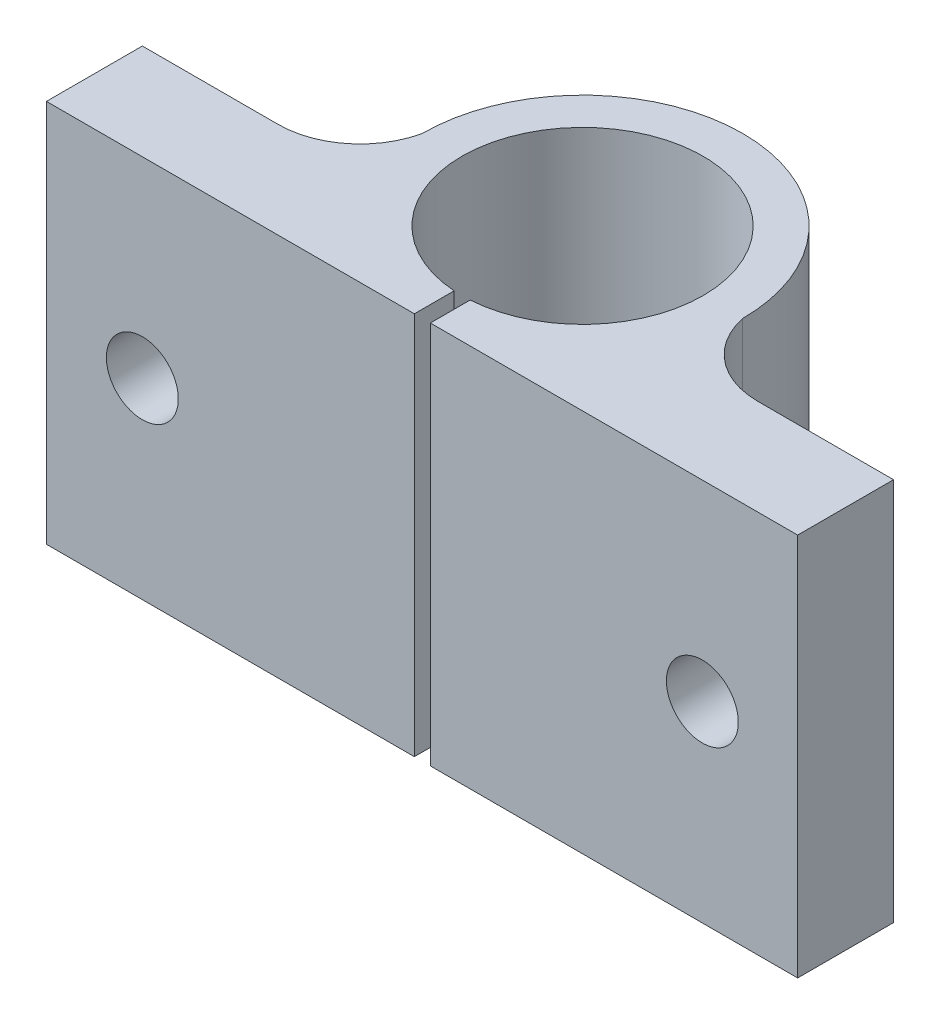
ISO-10303-21;
HEADER;
FILE_DESCRIPTION(('STEP AP214'),'2;1');
FILE_NAME('part.step','',(''),(''),'','','');
FILE_SCHEMA(('AUTOMOTIVE_DESIGN { 1 0 10303 214 1 1 1 1 }'));
ENDSEC;
DATA;
#1=APPLICATION_CONTEXT('core data for automotive mechanical design processes');
#2=APPLICATION_PROTOCOL_DEFINITION('international standard','automotive_design',2000,#1);
#3=PRODUCT_CONTEXT('',#1,'mechanical');
#4=PRODUCT('Part','Part','',(#3));
#5=PRODUCT_RELATED_PRODUCT_CATEGORY('part','',(#4));
#6=PRODUCT_DEFINITION_FORMATION('','',#4);
#7=PRODUCT_DEFINITION_CONTEXT('part definition',#1,'design');
#8=PRODUCT_DEFINITION('design','',#6,#7);
#9=PRODUCT_DEFINITION_SHAPE('','',#8);
#10=(LENGTH_UNIT() NAMED_UNIT(*) SI_UNIT(.MILLI.,.METRE.));
#11=(NAMED_UNIT(*) PLANE_ANGLE_UNIT() SI_UNIT($,.RADIAN.));
#12=(NAMED_UNIT(*) SI_UNIT($,.STERADIAN.) SOLID_ANGLE_UNIT());
#13=UNCERTAINTY_MEASURE_WITH_UNIT(LENGTH_MEASURE(1.E-05),#10,'distance_accuracy_value','');
#14=(GEOMETRIC_REPRESENTATION_CONTEXT(3) GLOBAL_UNCERTAINTY_ASSIGNED_CONTEXT((#13)) GLOBAL_UNIT_ASSIGNED_CONTEXT((#10,
#11,#12)) REPRESENTATION_CONTEXT('',''));
#15=CARTESIAN_POINT('',(0.,0.,0.));
#16=DIRECTION('',(0.,0.,1.));
#17=DIRECTION('',(1.,0.,0.));
#18=AXIS2_PLACEMENT_3D('',#15,#16,#17);
#19=CARTESIAN_POINT('',(0.,0.,0.));
#20=DIRECTION('',(0.,0.,1.));
#21=DIRECTION('',(1.,0.,0.));
#22=AXIS2_PLACEMENT_3D('',#19,#20,#21);
#23=PLANE('',#22);
#24=CARTESIAN_POINT('',(41.0372666212457,12.,0.));
#25=DIRECTION('',(0.,0.,-1.));
#26=DIRECTION('',(-1.,0.,0.));
#27=AXIS2_PLACEMENT_3D('',#24,#25,#26);
#28=CIRCLE('',#27,2.25000000000006);
#29=CARTESIAN_POINT('',(38.7872666212456,12.,0.));
#30=VERTEX_POINT('',#29);
#31=EDGE_CURVE('E224',#30,#30,#28,.T.);
#32=ORIENTED_EDGE('',*,*,#31,.T.);
#33=EDGE_LOOP('',(#32));
#34=FACE_BOUND('',#33,.T.);
#35=DIRECTION('',(0.,-1.,0.));
#36=VECTOR('',#35,1.);
#37=CARTESIAN_POINT('',(24.0186333106229,24.,0.));
#38=LINE('',#37,#36);
#39=CARTESIAN_POINT('',(24.0186333106229,24.,0.));
#40=VERTEX_POINT('',#39);
#41=CARTESIAN_POINT('',(24.0186333106229,0.,0.));
#42=VERTEX_POINT('',#41);
#43=EDGE_CURVE('E236',#40,#42,#38,.T.);
#44=ORIENTED_EDGE('',*,*,#43,.T.);
#45=DIRECTION('',(1.,0.,0.));
#46=VECTOR('',#45,1.);
#47=CARTESIAN_POINT('',(0.,0.,0.));
#48=LINE('',#47,#46);
#49=CARTESIAN_POINT('',(47.,0.,0.));
#50=VERTEX_POINT('',#49);
#51=EDGE_CURVE('E249',#42,#50,#48,.T.);
#52=ORIENTED_EDGE('',*,*,#51,.T.);
#53=DIRECTION('',(0.,1.,0.));
#54=VECTOR('',#53,1.);
#55=CARTESIAN_POINT('',(47.,0.,0.));
#56=LINE('',#55,#54);
#57=CARTESIAN_POINT('',(47.,24.,0.));
#58=VERTEX_POINT('',#57);
#59=EDGE_CURVE('E175',#50,#58,#56,.T.);
#60=ORIENTED_EDGE('',*,*,#59,.T.);
#61=DIRECTION('',(1.,0.,0.));
#62=VECTOR('',#61,1.);
#63=CARTESIAN_POINT('',(0.,24.,0.));
#64=LINE('',#63,#62);
#65=EDGE_CURVE('E149',#40,#58,#64,.T.);
#66=ORIENTED_EDGE('',*,*,#65,.F.);
#67=EDGE_LOOP('',(#44,#52,#60,#66));
#68=FACE_BOUND('',#67,.T.);
#69=ADVANCED_FACE('F34',(#34,#68),#23,.T.);
#70=CARTESIAN_POINT('',(0.,0.,-6.));
#71=DIRECTION('',(-1.,0.,0.));
#72=DIRECTION('',(0.,0.,1.));
#73=AXIS2_PLACEMENT_3D('',#70,#71,#72);
#74=PLANE('',#73);
#75=DIRECTION('',(0.,0.,1.));
#76=VECTOR('',#75,1.);
#77=CARTESIAN_POINT('',(0.,24.,-6.));
#78=LINE('',#77,#76);
#79=CARTESIAN_POINT('',(0.,24.,-6.));
#80=VERTEX_POINT('',#79);
#81=CARTESIAN_POINT('',(0.,24.,0.));
#82=VERTEX_POINT('',#81);
#83=EDGE_CURVE('E146',#80,#82,#78,.T.);
#84=ORIENTED_EDGE('',*,*,#83,.F.);
#85=DIRECTION('',(0.,1.,0.));
#86=VECTOR('',#85,1.);
#87=CARTESIAN_POINT('',(0.,0.,-6.));
#88=LINE('',#87,#86);
#89=CARTESIAN_POINT('',(0.,0.,-6.));
#90=VERTEX_POINT('',#89);
#91=EDGE_CURVE('E11',#90,#80,#88,.T.);
#92=ORIENTED_EDGE('',*,*,#91,.F.);
#93=DIRECTION('',(0.,0.,1.));
#94=VECTOR('',#93,1.);
#95=CARTESIAN_POINT('',(0.,0.,-6.));
#96=LINE('',#95,#94);
#97=CARTESIAN_POINT('',(0.,0.,0.));
#98=VERTEX_POINT('',#97);
#99=EDGE_CURVE('E168',#90,#98,#96,.T.);
#100=ORIENTED_EDGE('',*,*,#99,.T.);
#101=DIRECTION('',(0.,1.,0.));
#102=VECTOR('',#101,1.);
#103=CARTESIAN_POINT('',(0.,0.,0.));
#104=LINE('',#103,#102);
#105=EDGE_CURVE('E38',#98,#82,#104,.T.);
#106=ORIENTED_EDGE('',*,*,#105,.T.);
#107=EDGE_LOOP('',(#84,#92,#100,#106));
#108=FACE_BOUND('',#107,.T.);
#109=ADVANCED_FACE('F36',(#108),#74,.T.);
#110=CARTESIAN_POINT('',(8.50000000000001,0.,-6.));
#111=DIRECTION('',(0.,0.,-1.));
#112=DIRECTION('',(-1.,0.,0.));
#113=AXIS2_PLACEMENT_3D('',#110,#111,#112);
#114=PLANE('',#113);
#115=CARTESIAN_POINT('',(6.,12.,-6.00000000000001));
#116=DIRECTION('',(0.,0.,-1.));
#117=DIRECTION('',(-1.,0.,0.));
#118=AXIS2_PLACEMENT_3D('',#115,#116,#117);
#119=CIRCLE('',#118,2.25000000000007);
#120=CARTESIAN_POINT('',(3.74999999999994,12.,-6.00000000000001));
#121=VERTEX_POINT('',#120);
#122=EDGE_CURVE('E219',#121,#121,#119,.T.);
#123=ORIENTED_EDGE('',*,*,#122,.F.);
#124=EDGE_LOOP('',(#123));
#125=FACE_BOUND('',#124,.T.);
#126=DIRECTION('',(-1.,0.,0.));
#127=VECTOR('',#126,1.);
#128=CARTESIAN_POINT('',(8.50000000000001,24.,-6.));
#129=LINE('',#128,#127);
#130=CARTESIAN_POINT('',(8.50000000000001,24.,-6.00000000000002));
#131=VERTEX_POINT('',#130);
#132=EDGE_CURVE('E166',#131,#80,#129,.T.);
#133=ORIENTED_EDGE('',*,*,#132,.F.);
#134=DIRECTION('',(0.,1.,0.));
#135=VECTOR('',#134,1.);
#136=CARTESIAN_POINT('',(8.50000000000001,0.,-6.00000000000002));
#137=LINE('',#136,#135);
#138=CARTESIAN_POINT('',(8.50000000000001,0.,-6.00000000000002));
#139=VERTEX_POINT('',#138);
#140=EDGE_CURVE('E43',#139,#131,#137,.T.);
#141=ORIENTED_EDGE('',*,*,#140,.F.);
#142=DIRECTION('',(-1.,0.,0.));
#143=VECTOR('',#142,1.);
#144=CARTESIAN_POINT('',(8.50000000000001,0.,-6.));
#145=LINE('',#144,#143);
#146=EDGE_CURVE('E136',#139,#90,#145,.T.);
#147=ORIENTED_EDGE('',*,*,#146,.T.);
#148=ORIENTED_EDGE('',*,*,#91,.T.);
#149=EDGE_LOOP('',(#133,#141,#147,#148));
#150=FACE_BOUND('',#149,.T.);
#151=ADVANCED_FACE('F188',(#125,#150),#114,.T.);
#152=CARTESIAN_POINT('',(8.50000000000001,0.,-11.1210427356607));
#153=DIRECTION('',(0.,1.,0.));
#154=DIRECTION('',(0.,0.,1.));
#155=AXIS2_PLACEMENT_3D('',#152,#153,#154);
#156=CYLINDRICAL_SURFACE('',#155,5.12104273566066);
#157=CARTESIAN_POINT('',(8.50000000000001,24.,-11.1210427356607));
#158=DIRECTION('',(0.,-1.,0.));
#159=DIRECTION('',(0.,0.,-1.));
#160=AXIS2_PLACEMENT_3D('',#157,#158,#159);
#161=CIRCLE('',#160,5.12104273566066);
#162=CARTESIAN_POINT('',(13.4959473897421,24.,-9.99605901160399));
#163=VERTEX_POINT('',#162);
#164=EDGE_CURVE('E122',#163,#131,#161,.T.);
#165=ORIENTED_EDGE('',*,*,#164,.F.);
#166=DIRECTION('',(0.,1.,0.));
#167=VECTOR('',#166,1.);
#168=CARTESIAN_POINT('',(13.4959473897421,0.,-9.99605901160399));
#169=LINE('',#168,#167);
#170=CARTESIAN_POINT('',(13.4959473897421,0.,-9.99605901160399));
#171=VERTEX_POINT('',#170);
#172=EDGE_CURVE('E116',#171,#163,#169,.T.);
#173=ORIENTED_EDGE('',*,*,#172,.F.);
#174=CARTESIAN_POINT('',(8.50000000000001,0.,-11.1210427356607));
#175=DIRECTION('',(0.,-1.,0.));
#176=DIRECTION('',(0.,0.,-1.));
#177=AXIS2_PLACEMENT_3D('',#174,#175,#176);
#178=CIRCLE('',#177,5.12104273566066);
#179=EDGE_CURVE('E119',#171,#139,#178,.T.);
#180=ORIENTED_EDGE('',*,*,#179,.T.);
#181=ORIENTED_EDGE('',*,*,#140,.T.);
#182=EDGE_LOOP('',(#165,#173,#180,#181));
#183=FACE_BOUND('',#182,.T.);
#184=ADVANCED_FACE('F118',(#183),#156,.F.);
#185=CARTESIAN_POINT('',(23.5186333106229,0.,-10.0227213844719));
#186=DIRECTION('',(0.,1.,0.));
#187=DIRECTION('',(0.,0.,1.));
#188=AXIS2_PLACEMENT_3D('',#185,#186,#187);
#189=CYLINDRICAL_SURFACE('',#188,10.0227213844719);
#190=CARTESIAN_POINT('',(23.5186333106229,24.,-10.0227213844719));
#191=DIRECTION('',(0.,1.,0.));
#192=DIRECTION('',(0.,0.,1.));
#193=AXIS2_PLACEMENT_3D('',#190,#191,#192);
#194=CIRCLE('',#193,10.0227213844719);
#195=CARTESIAN_POINT('',(33.5413546555968,24.,-10.021831577252));
#196=VERTEX_POINT('',#195);
#197=EDGE_CURVE('E163',#196,#163,#194,.T.);
#198=ORIENTED_EDGE('',*,*,#197,.F.);
#199=DIRECTION('',(0.,1.,0.));
#200=VECTOR('',#199,1.);
#201=CARTESIAN_POINT('',(33.5413546555968,0.,-10.021831577252));
#202=LINE('',#201,#200);
#203=CARTESIAN_POINT('',(33.5413546555968,0.,-10.021831577252));
#204=VERTEX_POINT('',#203);
#205=EDGE_CURVE('E127',#204,#196,#202,.T.);
#206=ORIENTED_EDGE('',*,*,#205,.F.);
#207=CARTESIAN_POINT('',(23.5186333106229,0.,-10.0227213844719));
#208=DIRECTION('',(0.,1.,0.));
#209=DIRECTION('',(0.,0.,1.));
#210=AXIS2_PLACEMENT_3D('',#207,#208,#209);
#211=CIRCLE('',#210,10.0227213844719);
#212=EDGE_CURVE('E134',#204,#171,#211,.T.);
#213=ORIENTED_EDGE('',*,*,#212,.T.);
#214=ORIENTED_EDGE('',*,*,#172,.T.);
#215=EDGE_LOOP('',(#198,#206,#213,#214));
#216=FACE_BOUND('',#215,.T.);
#217=ADVANCED_FACE('F138',(#216),#189,.T.);
#218=CARTESIAN_POINT('',(38.5000000000001,0.,-11.0677523541657));
#219=DIRECTION('',(0.,1.,0.));
#220=DIRECTION('',(0.,0.,1.));
#221=AXIS2_PLACEMENT_3D('',#218,#219,#220);
#222=CYLINDRICAL_SURFACE('',#221,5.06775235416579);
#223=CARTESIAN_POINT('',(38.5000000000001,24.,-11.0677523541657));
#224=DIRECTION('',(0.,-1.,0.));
#225=DIRECTION('',(0.,0.,-1.));
#226=AXIS2_PLACEMENT_3D('',#223,#224,#225);
#227=CIRCLE('',#226,5.06775235416579);
#228=CARTESIAN_POINT('',(38.5,24.,-6.00000000000001));
#229=VERTEX_POINT('',#228);
#230=EDGE_CURVE('E160',#229,#196,#227,.T.);
#231=ORIENTED_EDGE('',*,*,#230,.F.);
#232=DIRECTION('',(0.,1.,0.));
#233=VECTOR('',#232,1.);
#234=CARTESIAN_POINT('',(38.5,0.,-6.00000000000001));
#235=LINE('',#234,#233);
#236=CARTESIAN_POINT('',(38.5,0.,-6.00000000000001));
#237=VERTEX_POINT('',#236);
#238=EDGE_CURVE('E172',#237,#229,#235,.T.);
#239=ORIENTED_EDGE('',*,*,#238,.F.);
#240=CARTESIAN_POINT('',(38.5000000000001,0.,-11.0677523541657));
#241=DIRECTION('',(0.,-1.,0.));
#242=DIRECTION('',(0.,0.,-1.));
#243=AXIS2_PLACEMENT_3D('',#240,#241,#242);
#244=CIRCLE('',#243,5.06775235416579);
#245=EDGE_CURVE('E139',#237,#204,#244,.T.);
#246=ORIENTED_EDGE('',*,*,#245,.T.);
#247=ORIENTED_EDGE('',*,*,#205,.T.);
#248=EDGE_LOOP('',(#231,#239,#246,#247));
#249=FACE_BOUND('',#248,.T.);
#250=ADVANCED_FACE('F307',(#249),#222,.F.);
#251=CARTESIAN_POINT('',(47.,0.,-6.));
#252=DIRECTION('',(0.,0.,-1.));
#253=DIRECTION('',(-1.,0.,0.));
#254=AXIS2_PLACEMENT_3D('',#251,#252,#253);
#255=PLANE('',#254);
#256=CARTESIAN_POINT('',(41.0372666212457,12.,-6.00000000000001));
#257=DIRECTION('',(0.,0.,-1.));
#258=DIRECTION('',(-1.,0.,0.));
#259=AXIS2_PLACEMENT_3D('',#256,#257,#258);
#260=CIRCLE('',#259,2.25000000000006);
#261=CARTESIAN_POINT('',(38.7872666212456,12.,-6.00000000000001));
#262=VERTEX_POINT('',#261);
#263=EDGE_CURVE('E303',#262,#262,#260,.T.);
#264=ORIENTED_EDGE('',*,*,#263,.F.);
#265=EDGE_LOOP('',(#264));
#266=FACE_BOUND('',#265,.T.);
#267=DIRECTION('',(-1.,0.,0.));
#268=VECTOR('',#267,1.);
#269=CARTESIAN_POINT('',(47.,24.,-6.));
#270=LINE('',#269,#268);
#271=CARTESIAN_POINT('',(47.,24.,-6.));
#272=VERTEX_POINT('',#271);
#273=EDGE_CURVE('E157',#272,#229,#270,.T.);
#274=ORIENTED_EDGE('',*,*,#273,.F.);
#275=DIRECTION('',(0.,1.,0.));
#276=VECTOR('',#275,1.);
#277=CARTESIAN_POINT('',(47.,0.,-6.));
#278=LINE('',#277,#276);
#279=CARTESIAN_POINT('',(47.,0.,-6.));
#280=VERTEX_POINT('',#279);
#281=EDGE_CURVE('E174',#280,#272,#278,.T.);
#282=ORIENTED_EDGE('',*,*,#281,.F.);
#283=DIRECTION('',(-1.,0.,0.));
#284=VECTOR('',#283,1.);
#285=CARTESIAN_POINT('',(47.,0.,-6.));
#286=LINE('',#285,#284);
#287=EDGE_CURVE('E141',#280,#237,#286,.T.);
#288=ORIENTED_EDGE('',*,*,#287,.T.);
#289=ORIENTED_EDGE('',*,*,#238,.T.);
#290=EDGE_LOOP('',(#274,#282,#288,#289));
#291=FACE_BOUND('',#290,.T.);
#292=ADVANCED_FACE('F213',(#266,#291),#255,.T.);
#293=CARTESIAN_POINT('',(47.,0.,0.));
#294=DIRECTION('',(1.,0.,0.));
#295=DIRECTION('',(0.,0.,-1.));
#296=AXIS2_PLACEMENT_3D('',#293,#294,#295);
#297=PLANE('',#296);
#298=DIRECTION('',(0.,0.,-1.));
#299=VECTOR('',#298,1.);
#300=CARTESIAN_POINT('',(47.,24.,0.));
#301=LINE('',#300,#299);
#302=EDGE_CURVE('E154',#58,#272,#301,.T.);
#303=ORIENTED_EDGE('',*,*,#302,.F.);
#304=ORIENTED_EDGE('',*,*,#59,.F.);
#305=DIRECTION('',(0.,0.,-1.));
#306=VECTOR('',#305,1.);
#307=CARTESIAN_POINT('',(47.,0.,0.));
#308=LINE('',#307,#306);
#309=EDGE_CURVE('E252',#50,#280,#308,.T.);
#310=ORIENTED_EDGE('',*,*,#309,.T.);
#311=ORIENTED_EDGE('',*,*,#281,.T.);
#312=EDGE_LOOP('',(#303,#304,#310,#311));
#313=FACE_BOUND('',#312,.T.);
#314=ADVANCED_FACE('F206',(#313),#297,.T.);
#315=CARTESIAN_POINT('',(6.,12.,0.));
#316=DIRECTION('',(0.,0.,-1.));
#317=DIRECTION('',(-1.,0.,0.));
#318=AXIS2_PLACEMENT_3D('',#315,#316,#317);
#319=CIRCLE('',#318,2.25000000000007);
#320=CARTESIAN_POINT('',(3.74999999999994,12.,0.));
#321=VERTEX_POINT('',#320);
#322=EDGE_CURVE('E217',#321,#321,#319,.T.);
#323=ORIENTED_EDGE('',*,*,#322,.T.);
#324=EDGE_LOOP('',(#323));
#325=FACE_BOUND('',#324,.T.);
#326=DIRECTION('',(0.,-1.,0.));
#327=VECTOR('',#326,1.);
#328=CARTESIAN_POINT('',(23.0186333106229,24.,0.));
#329=LINE('',#328,#327);
#330=CARTESIAN_POINT('',(23.0186333106229,24.,0.));
#331=VERTEX_POINT('',#330);
#332=CARTESIAN_POINT('',(23.0186333106229,0.,0.));
#333=VERTEX_POINT('',#332);
#334=EDGE_CURVE('E184',#331,#333,#329,.T.);
#335=ORIENTED_EDGE('',*,*,#334,.F.);
#336=EDGE_CURVE('E151',#82,#331,#64,.T.);
#337=ORIENTED_EDGE('',*,*,#336,.F.);
#338=ORIENTED_EDGE('',*,*,#105,.F.);
#339=EDGE_CURVE('E250',#98,#333,#48,.T.);
#340=ORIENTED_EDGE('',*,*,#339,.T.);
#341=EDGE_LOOP('',(#335,#337,#338,#340));
#342=FACE_BOUND('',#341,.T.);
#343=ADVANCED_FACE('F182',(#325,#342),#23,.T.);
#344=CARTESIAN_POINT('',(38.5000000000001,0.,-11.0677523541657));
#345=DIRECTION('',(0.,-1.,0.));
#346=DIRECTION('',(0.,0.,-1.));
#347=AXIS2_PLACEMENT_3D('',#344,#345,#346);
#348=PLANE('',#347);
#349=CARTESIAN_POINT('',(23.5186333106229,0.,-10.022721384472));
#350=DIRECTION('',(0.,1.,0.));
#351=DIRECTION('',(0.,0.,1.));
#352=AXIS2_PLACEMENT_3D('',#349,#350,#351);
#353=CIRCLE('',#352,7.55000000000005);
#354=CARTESIAN_POINT('',(24.0186333106229,0.,-2.48929586881175));
#355=VERTEX_POINT('',#354);
#356=CARTESIAN_POINT('',(23.0186333106229,0.,-2.48929586881175));
#357=VERTEX_POINT('',#356);
#358=EDGE_CURVE('E221',#355,#357,#353,.T.);
#359=ORIENTED_EDGE('',*,*,#358,.T.);
#360=DIRECTION('',(0.,0.,-1.));
#361=VECTOR('',#360,1.);
#362=CARTESIAN_POINT('',(23.0186333106229,0.,0.));
#363=LINE('',#362,#361);
#364=EDGE_CURVE('E234',#333,#357,#363,.T.);
#365=ORIENTED_EDGE('',*,*,#364,.F.);
#366=ORIENTED_EDGE('',*,*,#339,.F.);
#367=ORIENTED_EDGE('',*,*,#99,.F.);
#368=ORIENTED_EDGE('',*,*,#146,.F.);
#369=ORIENTED_EDGE('',*,*,#179,.F.);
#370=ORIENTED_EDGE('',*,*,#212,.F.);
#371=ORIENTED_EDGE('',*,*,#245,.F.);
#372=ORIENTED_EDGE('',*,*,#287,.F.);
#373=ORIENTED_EDGE('',*,*,#309,.F.);
#374=ORIENTED_EDGE('',*,*,#51,.F.);
#375=DIRECTION('',(0.,0.,1.));
#376=VECTOR('',#375,1.);
#377=CARTESIAN_POINT('',(24.0186333106229,0.,-2.48929586881175));
#378=LINE('',#377,#376);
#379=EDGE_CURVE('E229',#355,#42,#378,.T.);
#380=ORIENTED_EDGE('',*,*,#379,.F.);
#381=EDGE_LOOP('',(#359,#365,#366,#367,#368,#369,#370,#371,#372,#373,#374,#380));
#382=FACE_BOUND('',#381,.T.);
#383=ADVANCED_FACE('F132',(#382),#348,.T.);
#384=CARTESIAN_POINT('',(38.5000000000001,24.,-11.0677523541657));
#385=DIRECTION('',(0.,-1.,0.));
#386=DIRECTION('',(0.,0.,-1.));
#387=AXIS2_PLACEMENT_3D('',#384,#385,#386);
#388=PLANE('',#387);
#389=DIRECTION('',(0.,0.,-1.));
#390=VECTOR('',#389,1.);
#391=CARTESIAN_POINT('',(23.0186333106229,24.,0.));
#392=LINE('',#391,#390);
#393=CARTESIAN_POINT('',(23.0186333106229,24.,-2.48929586881175));
#394=VERTEX_POINT('',#393);
#395=EDGE_CURVE('E233',#331,#394,#392,.T.);
#396=ORIENTED_EDGE('',*,*,#395,.T.);
#397=CARTESIAN_POINT('',(23.5186333106229,24.,-10.022721384472));
#398=DIRECTION('',(0.,1.,0.));
#399=DIRECTION('',(0.,0.,1.));
#400=AXIS2_PLACEMENT_3D('',#397,#398,#399);
#401=CIRCLE('',#400,7.55000000000005);
#402=CARTESIAN_POINT('',(24.0186333106229,24.,-2.48929586881175));
#403=VERTEX_POINT('',#402);
#404=EDGE_CURVE('E51',#403,#394,#401,.T.);
#405=ORIENTED_EDGE('',*,*,#404,.F.);
#406=DIRECTION('',(0.,0.,1.));
#407=VECTOR('',#406,1.);
#408=CARTESIAN_POINT('',(24.0186333106229,24.,-2.48929586881175));
#409=LINE('',#408,#407);
#410=EDGE_CURVE('E230',#403,#40,#409,.T.);
#411=ORIENTED_EDGE('',*,*,#410,.T.);
#412=ORIENTED_EDGE('',*,*,#65,.T.);
#413=ORIENTED_EDGE('',*,*,#302,.T.);
#414=ORIENTED_EDGE('',*,*,#273,.T.);
#415=ORIENTED_EDGE('',*,*,#230,.T.);
#416=ORIENTED_EDGE('',*,*,#197,.T.);
#417=ORIENTED_EDGE('',*,*,#164,.T.);
#418=ORIENTED_EDGE('',*,*,#132,.T.);
#419=ORIENTED_EDGE('',*,*,#83,.T.);
#420=ORIENTED_EDGE('',*,*,#336,.T.);
#421=EDGE_LOOP('',(#396,#405,#411,#412,#413,#414,#415,#416,#417,#418,#419,#420));
#422=FACE_BOUND('',#421,.T.);
#423=ADVANCED_FACE('F187',(#422),#388,.F.);
#424=CARTESIAN_POINT('',(24.0186333106229,24.,-2.48929586881175));
#425=DIRECTION('',(1.,0.,0.));
#426=DIRECTION('',(0.,0.,-1.));
#427=AXIS2_PLACEMENT_3D('',#424,#425,#426);
#428=PLANE('',#427);
#429=ORIENTED_EDGE('',*,*,#379,.T.);
#430=ORIENTED_EDGE('',*,*,#43,.F.);
#431=ORIENTED_EDGE('',*,*,#410,.F.);
#432=DIRECTION('',(0.,-1.,0.));
#433=VECTOR('',#432,1.);
#434=CARTESIAN_POINT('',(24.0186333106229,24.,-2.48929586881175));
#435=LINE('',#434,#433);
#436=EDGE_CURVE('E150',#403,#355,#435,.T.);
#437=ORIENTED_EDGE('',*,*,#436,.T.);
#438=EDGE_LOOP('',(#429,#430,#431,#437));
#439=FACE_BOUND('',#438,.T.);
#440=ADVANCED_FACE('F278',(#439),#428,.F.);
#441=CARTESIAN_POINT('',(23.0186333106229,24.,0.));
#442=DIRECTION('',(-1.,0.,0.));
#443=DIRECTION('',(0.,0.,1.));
#444=AXIS2_PLACEMENT_3D('',#441,#442,#443);
#445=PLANE('',#444);
#446=ORIENTED_EDGE('',*,*,#364,.T.);
#447=DIRECTION('',(0.,-1.,0.));
#448=VECTOR('',#447,1.);
#449=CARTESIAN_POINT('',(23.0186333106229,24.,-2.48929586881175));
#450=LINE('',#449,#448);
#451=EDGE_CURVE('E243',#394,#357,#450,.T.);
#452=ORIENTED_EDGE('',*,*,#451,.F.);
#453=ORIENTED_EDGE('',*,*,#395,.F.);
#454=ORIENTED_EDGE('',*,*,#334,.T.);
#455=EDGE_LOOP('',(#446,#452,#453,#454));
#456=FACE_BOUND('',#455,.T.);
#457=ADVANCED_FACE('F280',(#456),#445,.F.);
#458=CARTESIAN_POINT('',(23.5186333106229,0.,-10.022721384472));
#459=DIRECTION('',(0.,1.,0.));
#460=DIRECTION('',(0.,0.,1.));
#461=AXIS2_PLACEMENT_3D('',#458,#459,#460);
#462=CYLINDRICAL_SURFACE('',#461,7.55000000000005);
#463=ORIENTED_EDGE('',*,*,#404,.T.);
#464=ORIENTED_EDGE('',*,*,#451,.T.);
#465=ORIENTED_EDGE('',*,*,#358,.F.);
#466=ORIENTED_EDGE('',*,*,#436,.F.);
#467=EDGE_LOOP('',(#463,#464,#465,#466));
#468=FACE_BOUND('',#467,.T.);
#469=ADVANCED_FACE('F277',(#468),#462,.F.);
#470=CARTESIAN_POINT('',(6.,12.,-6.00000000000001));
#471=DIRECTION('',(0.,0.,-1.));
#472=DIRECTION('',(-1.,0.,0.));
#473=AXIS2_PLACEMENT_3D('',#470,#471,#472);
#474=CYLINDRICAL_SURFACE('',#473,2.25000000000007);
#475=ORIENTED_EDGE('',*,*,#322,.F.);
#476=EDGE_LOOP('',(#475));
#477=FACE_BOUND('',#476,.T.);
#478=ORIENTED_EDGE('',*,*,#122,.T.);
#479=EDGE_LOOP('',(#478));
#480=FACE_BOUND('',#479,.T.);
#481=ADVANCED_FACE('F291',(#477,#480),#474,.F.);
#482=CARTESIAN_POINT('',(41.0372666212457,12.,-6.00000000000001));
#483=DIRECTION('',(0.,0.,-1.));
#484=DIRECTION('',(-1.,0.,0.));
#485=AXIS2_PLACEMENT_3D('',#482,#483,#484);
#486=CYLINDRICAL_SURFACE('',#485,2.25000000000006);
#487=ORIENTED_EDGE('',*,*,#31,.F.);
#488=EDGE_LOOP('',(#487));
#489=FACE_BOUND('',#488,.T.);
#490=ORIENTED_EDGE('',*,*,#263,.T.);
#491=EDGE_LOOP('',(#490));
#492=FACE_BOUND('',#491,.T.);
#493=ADVANCED_FACE('F294',(#489,#492),#486,.F.);
#494=CLOSED_SHELL('',(#69,#109,#151,#184,#217,#250,#292,#314,#343,#383,#423,#440,#457,#469,#481,#493));
#495=MANIFOLD_SOLID_BREP('B2',#494);
#496=ADVANCED_BREP_SHAPE_REPRESENTATION('',(#18,#495),#14);
#497=SHAPE_DEFINITION_REPRESENTATION(#9,#496);
ENDSEC;
END-ISO-10303-21;
